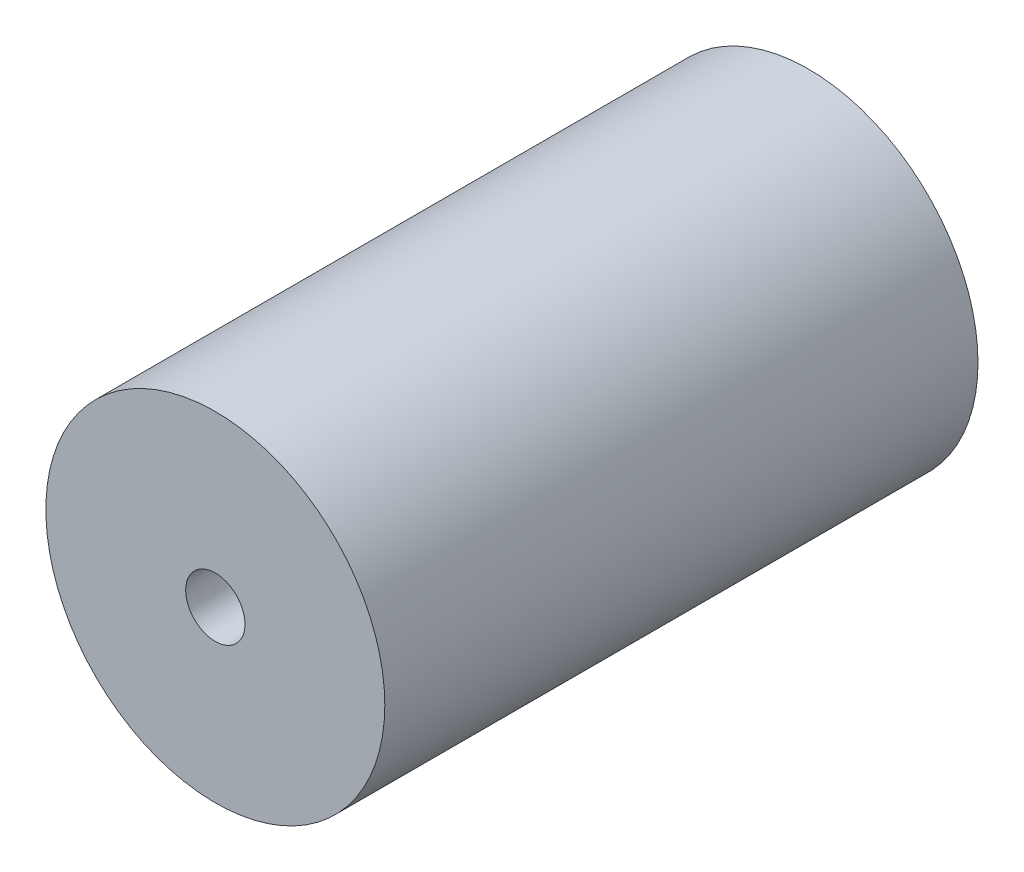
ISO-10303-21;
HEADER;
FILE_DESCRIPTION(('STEP AP214'),'2;1');
FILE_NAME('part.step','',(''),(''),'','','');
FILE_SCHEMA(('AUTOMOTIVE_DESIGN { 1 0 10303 214 1 1 1 1 }'));
ENDSEC;
DATA;
#1=APPLICATION_CONTEXT('core data for automotive mechanical design processes');
#2=APPLICATION_PROTOCOL_DEFINITION('international standard','automotive_design',2000,#1);
#3=PRODUCT_CONTEXT('',#1,'mechanical');
#4=PRODUCT('Part','Part','',(#3));
#5=PRODUCT_RELATED_PRODUCT_CATEGORY('part','',(#4));
#6=PRODUCT_DEFINITION_FORMATION('','',#4);
#7=PRODUCT_DEFINITION_CONTEXT('part definition',#1,'design');
#8=PRODUCT_DEFINITION('design','',#6,#7);
#9=PRODUCT_DEFINITION_SHAPE('','',#8);
#10=(LENGTH_UNIT() NAMED_UNIT(*) SI_UNIT(.MILLI.,.METRE.));
#11=(NAMED_UNIT(*) PLANE_ANGLE_UNIT() SI_UNIT($,.RADIAN.));
#12=(NAMED_UNIT(*) SI_UNIT($,.STERADIAN.) SOLID_ANGLE_UNIT());
#13=UNCERTAINTY_MEASURE_WITH_UNIT(LENGTH_MEASURE(1.E-05),#10,'distance_accuracy_value','');
#14=(GEOMETRIC_REPRESENTATION_CONTEXT(3) GLOBAL_UNCERTAINTY_ASSIGNED_CONTEXT((#13)) GLOBAL_UNIT_ASSIGNED_CONTEXT((#10,
#11,#12)) REPRESENTATION_CONTEXT('',''));
#15=CARTESIAN_POINT('',(0.,0.,0.));
#16=DIRECTION('',(0.,0.,1.));
#17=DIRECTION('',(1.,0.,0.));
#18=AXIS2_PLACEMENT_3D('',#15,#16,#17);
#19=CARTESIAN_POINT('',(0.,0.,175.));
#20=DIRECTION('',(0.,0.,-1.));
#21=DIRECTION('',(-1.,0.,0.));
#22=AXIS2_PLACEMENT_3D('',#19,#20,#21);
#23=CYLINDRICAL_SURFACE('',#22,100.);
#24=CARTESIAN_POINT('',(0.,0.,175.));
#25=DIRECTION('',(0.,0.,1.));
#26=DIRECTION('',(1.,0.,0.));
#27=AXIS2_PLACEMENT_3D('',#24,#25,#26);
#28=CIRCLE('',#27,100.);
#29=CARTESIAN_POINT('',(100.,0.,175.));
#30=VERTEX_POINT('',#29);
#31=EDGE_CURVE('E10',#30,#30,#28,.T.);
#32=ORIENTED_EDGE('',*,*,#31,.F.);
#33=EDGE_LOOP('',(#32));
#34=FACE_BOUND('',#33,.T.);
#35=CARTESIAN_POINT('',(0.,0.,-175.));
#36=DIRECTION('',(0.,0.,1.));
#37=DIRECTION('',(1.,0.,0.));
#38=AXIS2_PLACEMENT_3D('',#35,#36,#37);
#39=CIRCLE('',#38,100.);
#40=CARTESIAN_POINT('',(100.,0.,-175.));
#41=VERTEX_POINT('',#40);
#42=EDGE_CURVE('E44',#41,#41,#39,.T.);
#43=ORIENTED_EDGE('',*,*,#42,.T.);
#44=EDGE_LOOP('',(#43));
#45=FACE_BOUND('',#44,.T.);
#46=ADVANCED_FACE('F36',(#34,#45),#23,.T.);
#47=CARTESIAN_POINT('',(0.,0.,175.));
#48=DIRECTION('',(0.,0.,1.));
#49=DIRECTION('',(1.,0.,0.));
#50=AXIS2_PLACEMENT_3D('',#47,#48,#49);
#51=PLANE('',#50);
#52=CARTESIAN_POINT('',(0.,0.,175.));
#53=DIRECTION('',(0.,0.,-1.));
#54=DIRECTION('',(-1.,0.,0.));
#55=AXIS2_PLACEMENT_3D('',#52,#53,#54);
#56=CIRCLE('',#55,17.5);
#57=CARTESIAN_POINT('',(-17.5,0.,175.));
#58=VERTEX_POINT('',#57);
#59=EDGE_CURVE('E51',#58,#58,#56,.T.);
#60=ORIENTED_EDGE('',*,*,#59,.T.);
#61=EDGE_LOOP('',(#60));
#62=FACE_BOUND('',#61,.T.);
#63=ORIENTED_EDGE('',*,*,#31,.T.);
#64=EDGE_LOOP('',(#63));
#65=FACE_BOUND('',#64,.T.);
#66=ADVANCED_FACE('F71',(#62,#65),#51,.T.);
#67=CARTESIAN_POINT('',(0.,0.,-175.));
#68=DIRECTION('',(0.,0.,1.));
#69=DIRECTION('',(1.,0.,0.));
#70=AXIS2_PLACEMENT_3D('',#67,#68,#69);
#71=PLANE('',#70);
#72=CARTESIAN_POINT('',(0.,0.,-175.));
#73=DIRECTION('',(0.,0.,1.));
#74=DIRECTION('',(1.,0.,0.));
#75=AXIS2_PLACEMENT_3D('',#72,#73,#74);
#76=CIRCLE('',#75,17.5);
#77=CARTESIAN_POINT('',(17.5,0.,-175.));
#78=VERTEX_POINT('',#77);
#79=EDGE_CURVE('E39',#78,#78,#76,.T.);
#80=ORIENTED_EDGE('',*,*,#79,.T.);
#81=EDGE_LOOP('',(#80));
#82=FACE_BOUND('',#81,.T.);
#83=ORIENTED_EDGE('',*,*,#42,.F.);
#84=EDGE_LOOP('',(#83));
#85=FACE_BOUND('',#84,.T.);
#86=ADVANCED_FACE('F60',(#82,#85),#71,.F.);
#87=CARTESIAN_POINT('',(0.,0.,175.));
#88=DIRECTION('',(0.,0.,-1.));
#89=DIRECTION('',(-1.,0.,0.));
#90=AXIS2_PLACEMENT_3D('',#87,#88,#89);
#91=CYLINDRICAL_SURFACE('',#90,17.5);
#92=ORIENTED_EDGE('',*,*,#59,.F.);
#93=EDGE_LOOP('',(#92));
#94=FACE_BOUND('',#93,.T.);
#95=ORIENTED_EDGE('',*,*,#79,.F.);
#96=EDGE_LOOP('',(#95));
#97=FACE_BOUND('',#96,.T.);
#98=ADVANCED_FACE('F63',(#94,#97),#91,.F.);
#99=CLOSED_SHELL('',(#46,#66,#86,#98));
#100=MANIFOLD_SOLID_BREP('B2',#99);
#101=ADVANCED_BREP_SHAPE_REPRESENTATION('',(#18,#100),#14);
#102=SHAPE_DEFINITION_REPRESENTATION(#9,#101);
ENDSEC;
END-ISO-10303-21;
